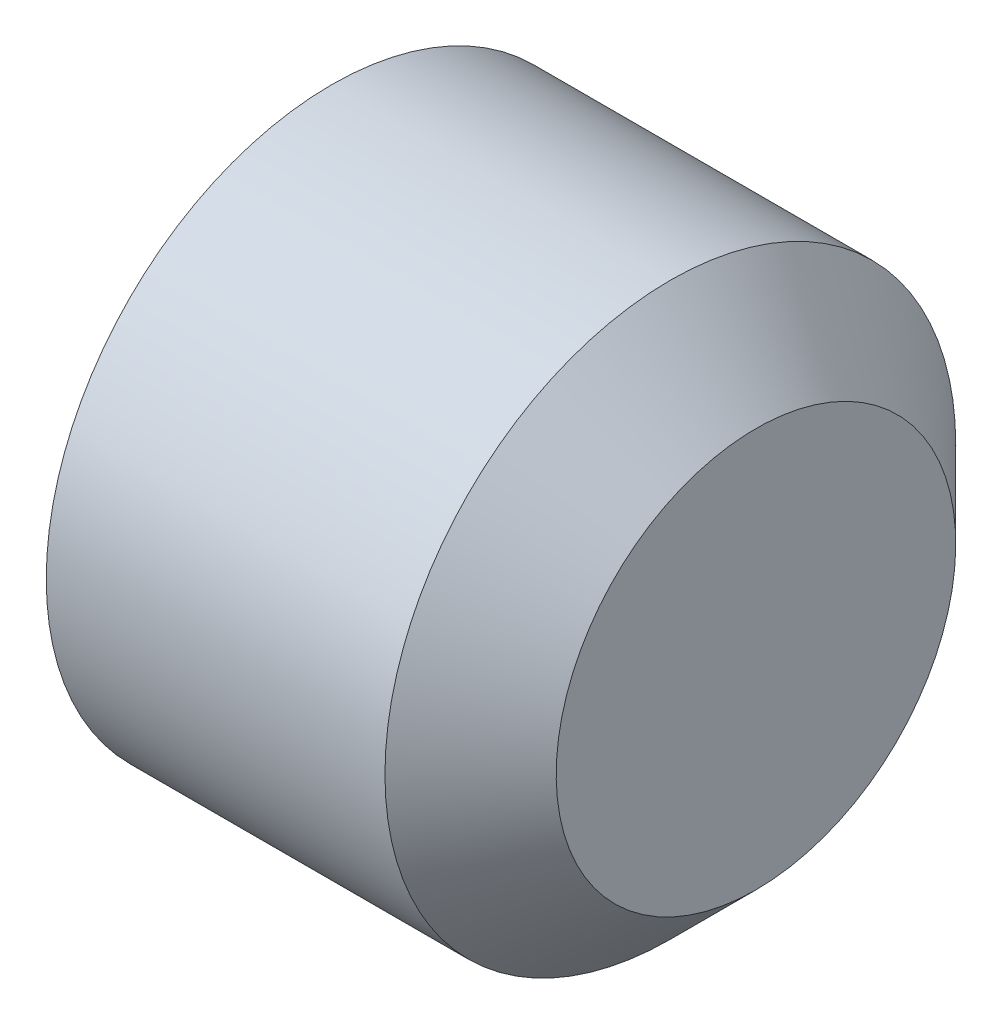
ISO-10303-21;
HEADER;
FILE_DESCRIPTION(('STEP AP214'),'2;1');
FILE_NAME('part.step','',(''),(''),'','','');
FILE_SCHEMA(('AUTOMOTIVE_DESIGN { 1 0 10303 214 1 1 1 1 }'));
ENDSEC;
DATA;
#1=APPLICATION_CONTEXT('core data for automotive mechanical design processes');
#2=APPLICATION_PROTOCOL_DEFINITION('international standard','automotive_design',2000,#1);
#3=PRODUCT_CONTEXT('',#1,'mechanical');
#4=PRODUCT('Part','Part','',(#3));
#5=PRODUCT_RELATED_PRODUCT_CATEGORY('part','',(#4));
#6=PRODUCT_DEFINITION_FORMATION('','',#4);
#7=PRODUCT_DEFINITION_CONTEXT('part definition',#1,'design');
#8=PRODUCT_DEFINITION('design','',#6,#7);
#9=PRODUCT_DEFINITION_SHAPE('','',#8);
#10=(LENGTH_UNIT() NAMED_UNIT(*) SI_UNIT(.MILLI.,.METRE.));
#11=(NAMED_UNIT(*) PLANE_ANGLE_UNIT() SI_UNIT($,.RADIAN.));
#12=(NAMED_UNIT(*) SI_UNIT($,.STERADIAN.) SOLID_ANGLE_UNIT());
#13=UNCERTAINTY_MEASURE_WITH_UNIT(LENGTH_MEASURE(1.E-05),#10,'distance_accuracy_value','');
#14=(GEOMETRIC_REPRESENTATION_CONTEXT(3) GLOBAL_UNCERTAINTY_ASSIGNED_CONTEXT((#13)) GLOBAL_UNIT_ASSIGNED_CONTEXT((#10,
#11,#12)) REPRESENTATION_CONTEXT('',''));
#15=CARTESIAN_POINT('',(0.,0.,0.));
#16=DIRECTION('',(0.,0.,1.));
#17=DIRECTION('',(1.,0.,0.));
#18=AXIS2_PLACEMENT_3D('',#15,#16,#17);
#19=CARTESIAN_POINT('',(0.83333333333333,0.,0.));
#20=DIRECTION('',(-1.,0.,0.));
#21=DIRECTION('',(0.,-1.,0.));
#22=AXIS2_PLACEMENT_3D('',#19,#20,#21);
#23=CONICAL_SURFACE('',#22,0.,1.04719755119661);
#24=CARTESIAN_POINT('',(0.,0.,0.));
#25=DIRECTION('',(-1.,0.,0.));
#26=DIRECTION('',(0.,-1.,0.));
#27=AXIS2_PLACEMENT_3D('',#24,#25,#26);
#28=CIRCLE('',#27,1.4433756729741);
#29=CARTESIAN_POINT('',(0.,0.,1.4433756729741));
#30=VERTEX_POINT('',#29);
#31=CARTESIAN_POINT('',(0.,1.25000000000006,0.721687836486994));
#32=VERTEX_POINT('',#31);
#33=EDGE_CURVE('E133',#30,#32,#28,.T.);
#34=ORIENTED_EDGE('',*,*,#33,.T.);
#35=CARTESIAN_POINT('',(-6.66746660057507E-05,1.2502,0.721572366433192));
#36=CARTESIAN_POINT('',(0.0182540852363299,1.19526669476824,0.753288124996229));
#37=CARTESIAN_POINT('',(0.0349166937993817,1.13985921349976,0.785277649221703));
#38=CARTESIAN_POINT('',(0.0640026960542466,1.02808463239966,0.849810733708406));
#39=CARTESIAN_POINT('',(0.0764157980239653,0.971715545158294,0.882355441401186));
#40=CARTESIAN_POINT('',(0.0957403123640013,0.859676025913021,0.947041487997324));
#41=CARTESIAN_POINT('',(0.10278031055258,0.804022841540777,0.979172868975901));
#42=CARTESIAN_POINT('',(0.111187567369377,0.692454346091617,1.04358696985656));
#43=CARTESIAN_POINT('',(0.112561784795285,0.636539441062409,1.07586945532689));
#44=CARTESIAN_POINT('',(0.109716662632088,0.532042078818284,1.13620103554814));
#45=CARTESIAN_POINT('',(0.106195901179992,0.483444050118692,1.16425912049994));
#46=CARTESIAN_POINT('',(0.0950328873007498,0.386564637826768,1.22019247526561));
#47=CARTESIAN_POINT('',(0.0873868144273279,0.338283589807842,1.2480675513361));
#48=CARTESIAN_POINT('',(0.0682705452994721,0.241204116145961,1.30411641158758));
#49=CARTESIAN_POINT('',(0.0567192430203453,0.192417989648104,1.33228309485383));
#50=CARTESIAN_POINT('',(0.0305016853061097,0.0955737477078994,1.38819614400748));
#51=CARTESIAN_POINT('',(0.0158415978608947,0.0475143896730365,1.41594322730599));
#52=CARTESIAN_POINT('',(-6.66746660267868E-05,-0.000199999999999914,1.44349114302794));
#53=B_SPLINE_CURVE_WITH_KNOTS('',3,(#35,#36,#37,#38,#39,#40,#41,#42,#43,#44,#45,#46,#47,#48,#49,
#50,#51,#52),.UNSPECIFIED.,.F.,.F.,(4,2,2,2,2,2,2,2,4),(0.,0.198150821029559,0.396778196315219,
0.590488617354397,0.783961049317179,0.952480056398648,1.1211553973001,1.29357430343591,
1.46565426976932),.UNSPECIFIED.);
#54=EDGE_CURVE('E11',#32,#30,#53,.T.);
#55=ORIENTED_EDGE('',*,*,#54,.T.);
#56=EDGE_LOOP('',(#34,#55));
#57=FACE_BOUND('',#56,.T.);
#58=ADVANCED_FACE('F31',(#57),#23,.F.);
#59=CARTESIAN_POINT('',(0.,-1.25,0.72168783648703));
#60=VERTEX_POINT('',#59);
#61=EDGE_CURVE('E129',#60,#30,#28,.T.);
#62=ORIENTED_EDGE('',*,*,#61,.T.);
#63=CARTESIAN_POINT('',(-6.66746660268218E-05,0.0002,1.44349114302794));
#64=CARTESIAN_POINT('',(0.0182540852363107,-0.0547333052317656,1.4117753844649));
#65=CARTESIAN_POINT('',(0.0349166937993643,-0.11014078650024,1.37978586023943));
#66=CARTESIAN_POINT('',(0.064002696054233,-0.221915367600341,1.31525277575272));
#67=CARTESIAN_POINT('',(0.0764157980239536,-0.278284454841712,1.28270806805994));
#68=CARTESIAN_POINT('',(0.0957403123639935,-0.390323974086986,1.2180220214638));
#69=CARTESIAN_POINT('',(0.102780310552574,-0.445977158459232,1.18589064048522));
#70=CARTESIAN_POINT('',(0.111187567369375,-0.557545653908395,1.12147653960457));
#71=CARTESIAN_POINT('',(0.112561784795285,-0.613460558937604,1.08919405413424));
#72=CARTESIAN_POINT('',(0.109716662632091,-0.717957921181728,1.02886247391298));
#73=CARTESIAN_POINT('',(0.106195901179996,-0.766555949881319,1.00080438896119));
#74=CARTESIAN_POINT('',(0.0950328873007579,-0.863435362173241,0.944871034195512));
#75=CARTESIAN_POINT('',(0.0873868144273378,-0.911716410192165,0.916995958125027));
#76=CARTESIAN_POINT('',(0.0682705452994854,-1.00879588385404,0.860947097873551));
#77=CARTESIAN_POINT('',(0.0567192430203601,-1.0575820103519,0.832780414607293));
#78=CARTESIAN_POINT('',(0.0305016853061277,-1.1544262522921,0.776867365453649));
#79=CARTESIAN_POINT('',(0.0158415978609142,-1.20248561032696,0.74912028215514));
#80=CARTESIAN_POINT('',(-6.66746660054578E-05,-1.2502,0.721572366433192));
#81=B_SPLINE_CURVE_WITH_KNOTS('',3,(#63,#64,#65,#66,#67,#68,#69,#70,#71,#72,#73,#74,#75,#76,#77,
#78,#79,#80),.UNSPECIFIED.,.F.,.F.,(4,2,2,2,2,2,2,2,4),(0.,0.198150821029564,0.396778196315229,
0.590488617354412,0.783961049317198,0.952480056398663,1.12115539730011,1.29357430343592,
1.46565426976932),.UNSPECIFIED.);
#82=EDGE_CURVE('E44',#30,#60,#81,.T.);
#83=ORIENTED_EDGE('',*,*,#82,.T.);
#84=EDGE_LOOP('',(#62,#83));
#85=FACE_BOUND('',#84,.T.);
#86=ADVANCED_FACE('F199',(#85),#23,.F.);
#87=CARTESIAN_POINT('',(0.,-1.25,-0.72168783648703));
#88=VERTEX_POINT('',#87);
#89=EDGE_CURVE('E128',#88,#60,#28,.T.);
#90=ORIENTED_EDGE('',*,*,#89,.T.);
#91=CARTESIAN_POINT('',(-0.464794110924318,-1.25,-1.8689314017922));
#92=CARTESIAN_POINT('',(-0.438896838466503,-1.25,-1.81495202267028));
#93=CARTESIAN_POINT('',(-0.41326862193117,-1.25,-1.76084125344199));
#94=CARTESIAN_POINT('',(-0.362702760613372,-1.25,-1.65228662652069));
#95=CARTESIAN_POINT('',(-0.337765240110292,-1.25,-1.5978427110077));
#96=CARTESIAN_POINT('',(-0.288593916349812,-1.25,-1.48823931692677));
#97=CARTESIAN_POINT('',(-0.26436529948678,-1.25,-1.43307750108909));
#98=CARTESIAN_POINT('',(-0.216995070503893,-1.25,-1.32229188443623));
#99=CARTESIAN_POINT('',(-0.1938534018645,-1.25,-1.26666810781964));
#100=CARTESIAN_POINT('',(-0.148354613067788,-1.25,-1.15340083047609));
#101=CARTESIAN_POINT('',(-0.126033815465283,-1.25,-1.09574254265117));
#102=CARTESIAN_POINT('',(-0.0832554769119706,-1.25,-0.979741082890187));
#103=CARTESIAN_POINT('',(-0.0627981694396737,-1.25,-0.921397826164648));
#104=CARTESIAN_POINT('',(-0.00508423767620013,-1.25,-0.745435524772247));
#105=CARTESIAN_POINT('',(0.0286497850231129,-1.25,-0.626561938132864));
#106=CARTESIAN_POINT('',(0.0677795931717896,-1.25,-0.445873083681241));
#107=CARTESIAN_POINT('',(0.0789059393811716,-1.25,-0.38530470019277));
#108=CARTESIAN_POINT('',(0.0965721477324262,-1.25,-0.263486592065033));
#109=CARTESIAN_POINT('',(0.103112319816836,-1.25,-0.202236913753249));
#110=CARTESIAN_POINT('',(0.111001218957225,-1.25,-0.0801324468775871));
#111=CARTESIAN_POINT('',(0.112411208741845,-1.25,-0.019281719788719));
#112=CARTESIAN_POINT('',(0.110083812113811,-1.25,0.102319232701149));
#113=CARTESIAN_POINT('',(0.106346106973973,-1.25,0.163069451645857));
#114=CARTESIAN_POINT('',(0.0911019719638763,-1.25,0.312961598922923));
#115=CARTESIAN_POINT('',(0.0767387515703198,-1.25,0.401813055628261));
#116=CARTESIAN_POINT('',(0.0397001504850786,-1.25,0.577788146583204));
#117=CARTESIAN_POINT('',(0.0170147516458729,-1.25,0.664909564430757));
#118=CARTESIAN_POINT('',(-0.0217374532821145,-1.25,0.795209224728803));
#119=CARTESIAN_POINT('',(-0.0356229448102494,-1.25,0.839061001813546));
#120=CARTESIAN_POINT('',(-0.0646784153621007,-1.25,0.926308087473968));
#121=CARTESIAN_POINT('',(-0.0798475927664179,-1.25,0.969703662172476));
#122=CARTESIAN_POINT('',(-0.111250133996538,-1.25,1.05609633508796));
#123=CARTESIAN_POINT('',(-0.127483304422964,-1.25,1.09909350410935));
#124=CARTESIAN_POINT('',(-0.160838243910764,-1.25,1.18474903910482));
#125=CARTESIAN_POINT('',(-0.177960163104321,-1.25,1.22740734642401));
#126=CARTESIAN_POINT('',(-0.222761429232114,-1.25,1.33629459550827));
#127=CARTESIAN_POINT('',(-0.250969383573501,-1.25,1.40230581092031));
#128=CARTESIAN_POINT('',(-0.308745081158461,-1.25,1.53373213594215));
#129=CARTESIAN_POINT('',(-0.338312926269894,-1.25,1.59914720045377));
#130=CARTESIAN_POINT('',(-0.428576920024366,-1.25,1.79469680395945));
#131=CARTESIAN_POINT('',(-0.490824273185166,-1.25,1.92411390982371));
#132=CARTESIAN_POINT('',(-0.617929622902712,-1.25,2.18184246876939));
#133=CARTESIAN_POINT('',(-0.682790734765016,-1.25,2.31015236703664));
#134=CARTESIAN_POINT('',(-0.814180745531417,-1.25,2.56589305685458));
#135=CARTESIAN_POINT('',(-0.880709432442646,-1.25,2.6933239575489));
#136=CARTESIAN_POINT('',(-1.0085820016458,-1.25,2.93557826301824));
#137=CARTESIAN_POINT('',(-1.06982257041214,-1.25,3.05045639113078));
#138=CARTESIAN_POINT('',(-1.19300148004088,-1.25,3.27984311898858));
#139=CARTESIAN_POINT('',(-1.25493984672611,-1.25,3.39435170485541));
#140=CARTESIAN_POINT('',(-1.3791811560561,-1.25,3.62279327872171));
#141=CARTESIAN_POINT('',(-1.44148277067592,-1.25,3.73672698995316));
#142=CARTESIAN_POINT('',(-1.56649149193143,-1.25,3.96436406629498));
#143=CARTESIAN_POINT('',(-1.62919857717608,-1.25,4.07806744314791));
#144=CARTESIAN_POINT('',(-1.69205434936227,-1.25,4.19168806612957));
#145=B_SPLINE_CURVE_WITH_KNOTS('',3,(#91,#92,#93,#94,#95,#96,#97,#98,#99,#100,#101,#102,#103,
#104,#105,#106,#107,#108,#109,#110,#111,#112,#113,#114,#115,#116,#117,#118,#119,#120,#121,#122,
#123,#124,#125,#126,#127,#128,#129,#130,#131,#132,#133,#134,#135,#136,#137,#138,#139,#140,#141,
#142,#143,#144),.UNSPECIFIED.,.F.,.F.,(4,2,2,2,2,2,2,2,2,2,2,2,2,2,2,2,2,2,2,2,2,2,2,2,2,2,4),
(0.,0.17961292671252,0.359257964580633,0.539992735616922,0.720718098311231,0.906167781883899,
1.09164066876281,1.46154014621253,1.64614554413151,1.83073846485716,2.01311967401944,
2.1955121760931,2.46497297688039,2.73475922178122,2.87273702323334,3.01062928909403,
3.14849655975692,3.28638719597095,3.50172172546914,3.71707241178646,4.14784491349871,
4.57914698286388,5.01039449766875,5.40093821140483,5.79149642546544,6.18106124184777,
6.57060567131898),.UNSPECIFIED.);
#146=EDGE_CURVE('E175',#60,#88,#145,.F.);
#147=ORIENTED_EDGE('',*,*,#146,.T.);
#148=EDGE_LOOP('',(#90,#147));
#149=FACE_BOUND('',#148,.T.);
#150=ADVANCED_FACE('F205',(#149),#23,.F.);
#151=CARTESIAN_POINT('',(0.,0.,-1.4433756729741));
#152=VERTEX_POINT('',#151);
#153=EDGE_CURVE('E227',#152,#88,#28,.T.);
#154=ORIENTED_EDGE('',*,*,#153,.T.);
#155=CARTESIAN_POINT('',(-6.66746660055277E-05,-1.2502,-0.721572366433192));
#156=CARTESIAN_POINT('',(0.0182540852363301,-1.19526669476824,-0.753288124996229));
#157=CARTESIAN_POINT('',(0.0349166937993819,-1.13985921349976,-0.785277649221703));
#158=CARTESIAN_POINT('',(0.0640026960542469,-1.02808463239966,-0.849810733708406));
#159=CARTESIAN_POINT('',(0.0764157980239655,-0.971715545158294,-0.882355441401186));
#160=CARTESIAN_POINT('',(0.0957403123640015,-0.859676025913021,-0.947041487997324));
#161=CARTESIAN_POINT('',(0.10278031055258,-0.804022841540777,-0.979172868975901));
#162=CARTESIAN_POINT('',(0.111187567369377,-0.692454346091617,-1.04358696985656));
#163=CARTESIAN_POINT('',(0.112561784795285,-0.636539441062409,-1.07586945532689));
#164=CARTESIAN_POINT('',(0.109716662632088,-0.532042078818284,-1.13620103554814));
#165=CARTESIAN_POINT('',(0.106195901179992,-0.483444050118692,-1.16425912049994));
#166=CARTESIAN_POINT('',(0.0950328873007499,-0.386564637826768,-1.22019247526561));
#167=CARTESIAN_POINT('',(0.087386814427328,-0.338283589807842,-1.2480675513361));
#168=CARTESIAN_POINT('',(0.0682705452994722,-0.241204116145961,-1.30411641158758));
#169=CARTESIAN_POINT('',(0.0567192430203453,-0.192417989648104,-1.33228309485383));
#170=CARTESIAN_POINT('',(0.0305016853061096,-0.0955737477078995,-1.38819614400748));
#171=CARTESIAN_POINT('',(0.0158415978608945,-0.0475143896730366,-1.41594322730599));
#172=CARTESIAN_POINT('',(-6.66746660268274E-05,0.000199999999999906,-1.44349114302794));
#173=B_SPLINE_CURVE_WITH_KNOTS('',3,(#155,#156,#157,#158,#159,#160,#161,#162,#163,#164,#165,
#166,#167,#168,#169,#170,#171,#172),.UNSPECIFIED.,.F.,.F.,(4,2,2,2,2,2,2,2,4),(0.,
0.198150821029559,0.396778196315219,0.590488617354397,0.783961049317179,0.952480056398648,
1.1211553973001,1.29357430343591,1.46565426976932),.UNSPECIFIED.);
#174=EDGE_CURVE('E170',#88,#152,#173,.T.);
#175=ORIENTED_EDGE('',*,*,#174,.T.);
#176=EDGE_LOOP('',(#154,#175));
#177=FACE_BOUND('',#176,.T.);
#178=ADVANCED_FACE('F217',(#177),#23,.F.);
#179=CARTESIAN_POINT('',(0.,1.25,-0.72168783648703));
#180=VERTEX_POINT('',#179);
#181=EDGE_CURVE('E225',#180,#152,#28,.T.);
#182=ORIENTED_EDGE('',*,*,#181,.T.);
#183=CARTESIAN_POINT('',(-6.66746660268218E-05,-0.0002,-1.44349114302794));
#184=CARTESIAN_POINT('',(0.0182540852363106,0.0547333052317654,-1.4117753844649));
#185=CARTESIAN_POINT('',(0.0349166937993642,0.11014078650024,-1.37978586023943));
#186=CARTESIAN_POINT('',(0.064002696054233,0.221915367600341,-1.31525277575272));
#187=CARTESIAN_POINT('',(0.0764157980239536,0.278284454841712,-1.28270806805994));
#188=CARTESIAN_POINT('',(0.0957403123639934,0.390323974086986,-1.2180220214638));
#189=CARTESIAN_POINT('',(0.102780310552574,0.445977158459232,-1.18589064048522));
#190=CARTESIAN_POINT('',(0.111187567369375,0.557545653908395,-1.12147653960457));
#191=CARTESIAN_POINT('',(0.112561784795285,0.613460558937604,-1.08919405413424));
#192=CARTESIAN_POINT('',(0.109716662632091,0.717957921181728,-1.02886247391298));
#193=CARTESIAN_POINT('',(0.106195901179996,0.766555949881319,-1.00080438896119));
#194=CARTESIAN_POINT('',(0.0950328873007577,0.863435362173241,-0.944871034195511));
#195=CARTESIAN_POINT('',(0.0873868144273375,0.911716410192165,-0.916995958125027));
#196=CARTESIAN_POINT('',(0.068270545299485,1.00879588385404,-0.86094709787355));
#197=CARTESIAN_POINT('',(0.0567192430203599,1.0575820103519,-0.832780414607293));
#198=CARTESIAN_POINT('',(0.0305016853061276,1.1544262522921,-0.776867365453649));
#199=CARTESIAN_POINT('',(0.0158415978609141,1.20248561032696,-0.749120282155139));
#200=CARTESIAN_POINT('',(-6.66746660056587E-05,1.2502,-0.721572366433192));
#201=B_SPLINE_CURVE_WITH_KNOTS('',3,(#183,#184,#185,#186,#187,#188,#189,#190,#191,#192,#193,
#194,#195,#196,#197,#198,#199,#200),.UNSPECIFIED.,.F.,.F.,(4,2,2,2,2,2,2,2,4),(0.,
0.198150821029563,0.396778196315229,0.590488617354411,0.783961049317198,0.952480056398663,
1.12115539730011,1.29357430343592,1.46565426976932),.UNSPECIFIED.);
#202=EDGE_CURVE('E111',#152,#180,#201,.T.);
#203=ORIENTED_EDGE('',*,*,#202,.T.);
#204=EDGE_LOOP('',(#182,#203));
#205=FACE_BOUND('',#204,.T.);
#206=ADVANCED_FACE('F209',(#205),#23,.F.);
#207=EDGE_CURVE('E221',#32,#180,#28,.T.);
#208=ORIENTED_EDGE('',*,*,#207,.T.);
#209=CARTESIAN_POINT('',(-0.464794110924318,1.25,-1.8689314017922));
#210=CARTESIAN_POINT('',(-0.438896838466503,1.25,-1.81495202267028));
#211=CARTESIAN_POINT('',(-0.41326862193117,1.25,-1.76084125344199));
#212=CARTESIAN_POINT('',(-0.362702760613372,1.25,-1.65228662652069));
#213=CARTESIAN_POINT('',(-0.337765240110292,1.25,-1.5978427110077));
#214=CARTESIAN_POINT('',(-0.288593916349812,1.25,-1.48823931692677));
#215=CARTESIAN_POINT('',(-0.26436529948678,1.25,-1.43307750108909));
#216=CARTESIAN_POINT('',(-0.216995070503893,1.25,-1.32229188443623));
#217=CARTESIAN_POINT('',(-0.1938534018645,1.25,-1.26666810781964));
#218=CARTESIAN_POINT('',(-0.148354613067788,1.25,-1.15340083047609));
#219=CARTESIAN_POINT('',(-0.126033815465283,1.25,-1.09574254265117));
#220=CARTESIAN_POINT('',(-0.0832554769119707,1.25,-0.979741082890186));
#221=CARTESIAN_POINT('',(-0.0627981694396738,1.25,-0.921397826164648));
#222=CARTESIAN_POINT('',(-0.00508423767620024,1.25,-0.745435524772247));
#223=CARTESIAN_POINT('',(0.0286497850231128,1.25,-0.626561938132864));
#224=CARTESIAN_POINT('',(0.0677795931717894,1.25,-0.445873083681241));
#225=CARTESIAN_POINT('',(0.0789059393811713,1.25,-0.38530470019277));
#226=CARTESIAN_POINT('',(0.0965721477324259,1.25,-0.263486592065032));
#227=CARTESIAN_POINT('',(0.103112319816836,1.25,-0.202236913753249));
#228=CARTESIAN_POINT('',(0.111001218957225,1.25,-0.0801324468775868));
#229=CARTESIAN_POINT('',(0.112411208741845,1.25,-0.0192817197887186));
#230=CARTESIAN_POINT('',(0.110083812113811,1.25,0.10231923270115));
#231=CARTESIAN_POINT('',(0.106346106973973,1.25,0.163069451645857));
#232=CARTESIAN_POINT('',(0.091101971963876,1.25,0.312961598922923));
#233=CARTESIAN_POINT('',(0.0767387515703196,1.25,0.401813055628261));
#234=CARTESIAN_POINT('',(0.0397001504850782,1.25,0.577788146583204));
#235=CARTESIAN_POINT('',(0.0170147516458725,1.25,0.664909564430757));
#236=CARTESIAN_POINT('',(-0.0217374532821147,1.25,0.795209224728803));
#237=CARTESIAN_POINT('',(-0.0356229448102494,1.25,0.839061001813546));
#238=CARTESIAN_POINT('',(-0.0646784153621006,1.25,0.926308087473968));
#239=CARTESIAN_POINT('',(-0.0798475927664179,1.25,0.969703662172475));
#240=CARTESIAN_POINT('',(-0.111250133996538,1.25,1.05609633508796));
#241=CARTESIAN_POINT('',(-0.127483304422964,1.25,1.09909350410935));
#242=CARTESIAN_POINT('',(-0.160838243910764,1.25,1.18474903910482));
#243=CARTESIAN_POINT('',(-0.177960163104321,1.25,1.22740734642401));
#244=CARTESIAN_POINT('',(-0.222761429232114,1.25,1.33629459550828));
#245=CARTESIAN_POINT('',(-0.250969383573501,1.25,1.40230581092031));
#246=CARTESIAN_POINT('',(-0.30874508115846,1.25,1.53373213594215));
#247=CARTESIAN_POINT('',(-0.338312926269894,1.25,1.59914720045377));
#248=CARTESIAN_POINT('',(-0.428576920024366,1.25,1.79469680395945));
#249=CARTESIAN_POINT('',(-0.490824273185166,1.25,1.92411390982371));
#250=CARTESIAN_POINT('',(-0.617929622902713,1.25,2.18184246876939));
#251=CARTESIAN_POINT('',(-0.682790734765016,1.25,2.31015236703664));
#252=CARTESIAN_POINT('',(-0.814180745531417,1.25,2.56589305685458));
#253=CARTESIAN_POINT('',(-0.880709432442647,1.25,2.6933239575489));
#254=CARTESIAN_POINT('',(-1.0085820016458,1.25,2.93557826301824));
#255=CARTESIAN_POINT('',(-1.06982257041214,1.25,3.05045639113078));
#256=CARTESIAN_POINT('',(-1.19300148004088,1.25,3.27984311898858));
#257=CARTESIAN_POINT('',(-1.25493984672611,1.25,3.39435170485541));
#258=CARTESIAN_POINT('',(-1.3791811560561,1.25,3.62279327872171));
#259=CARTESIAN_POINT('',(-1.44148277067592,1.25,3.73672698995316));
#260=CARTESIAN_POINT('',(-1.56649149193143,1.25,3.96436406629498));
#261=CARTESIAN_POINT('',(-1.62919857717608,1.25,4.07806744314791));
#262=CARTESIAN_POINT('',(-1.69205434936227,1.25,4.19168806612957));
#263=B_SPLINE_CURVE_WITH_KNOTS('',3,(#209,#210,#211,#212,#213,#214,#215,#216,#217,#218,#219,
#220,#221,#222,#223,#224,#225,#226,#227,#228,#229,#230,#231,#232,#233,#234,#235,#236,#237,#238,
#239,#240,#241,#242,#243,#244,#245,#246,#247,#248,#249,#250,#251,#252,#253,#254,#255,#256,#257,
#258,#259,#260,#261,#262),.UNSPECIFIED.,.F.,.F.,(4,2,2,2,2,2,2,2,2,2,2,2,2,2,2,2,2,2,2,2,2,2,2,
2,2,2,4),(0.,0.17961292671252,0.359257964580634,0.539992735616922,0.720718098311231,
0.9061677818839,1.09164066876281,1.46154014621253,1.64614554413151,1.83073846485716,
2.01311967401944,2.1955121760931,2.46497297688039,2.73475922178122,2.87273702323334,
3.01062928909402,3.14849655975692,3.28638719597095,3.50172172546914,3.71707241178646,
4.14784491349871,4.57914698286388,5.01039449766875,5.40093821140483,5.79149642546544,
6.18106124184777,6.57060567131898),.UNSPECIFIED.);
#264=EDGE_CURVE('E77',#180,#32,#263,.T.);
#265=ORIENTED_EDGE('',*,*,#264,.T.);
#266=EDGE_LOOP('',(#208,#265));
#267=FACE_BOUND('',#266,.T.);
#268=ADVANCED_FACE('F201',(#267),#23,.F.);
#269=CARTESIAN_POINT('',(4.,0.,0.));
#270=DIRECTION('',(1.,0.,0.));
#271=DIRECTION('',(0.,1.,0.));
#272=AXIS2_PLACEMENT_3D('',#269,#270,#271);
#273=PLANE('',#272);
#274=CARTESIAN_POINT('',(4.,0.,0.));
#275=DIRECTION('',(-1.,0.,0.));
#276=DIRECTION('',(0.,-1.,0.));
#277=AXIS2_PLACEMENT_3D('',#274,#275,#276);
#278=CIRCLE('',#277,1.75);
#279=CARTESIAN_POINT('',(4.,-1.75,0.));
#280=VERTEX_POINT('',#279);
#281=EDGE_CURVE('E142',#280,#280,#278,.T.);
#282=ORIENTED_EDGE('',*,*,#281,.F.);
#283=EDGE_LOOP('',(#282));
#284=FACE_BOUND('',#283,.T.);
#285=ADVANCED_FACE('F33',(#284),#273,.T.);
#286=CARTESIAN_POINT('',(3.25,0.,0.));
#287=DIRECTION('',(-1.,0.,0.));
#288=DIRECTION('',(0.,-1.,0.));
#289=AXIS2_PLACEMENT_3D('',#286,#287,#288);
#290=CONICAL_SURFACE('',#289,2.5,0.785398163397448);
#291=ORIENTED_EDGE('',*,*,#281,.T.);
#292=EDGE_LOOP('',(#291));
#293=FACE_BOUND('',#292,.T.);
#294=CARTESIAN_POINT('',(3.25,0.,0.));
#295=DIRECTION('',(-1.,0.,0.));
#296=DIRECTION('',(0.,-1.,0.));
#297=AXIS2_PLACEMENT_3D('',#294,#295,#296);
#298=CIRCLE('',#297,2.5);
#299=CARTESIAN_POINT('',(3.25,-2.5,0.));
#300=VERTEX_POINT('',#299);
#301=EDGE_CURVE('E139',#300,#300,#298,.T.);
#302=ORIENTED_EDGE('',*,*,#301,.F.);
#303=EDGE_LOOP('',(#302));
#304=FACE_BOUND('',#303,.T.);
#305=ADVANCED_FACE('F215',(#293,#304),#290,.T.);
#306=CARTESIAN_POINT('',(0.83333333333333,0.,0.));
#307=DIRECTION('',(-1.,0.,0.));
#308=DIRECTION('',(0.,-1.,0.));
#309=AXIS2_PLACEMENT_3D('',#306,#307,#308);
#310=CYLINDRICAL_SURFACE('',#309,2.5);
#311=ORIENTED_EDGE('',*,*,#301,.T.);
#312=EDGE_LOOP('',(#311));
#313=FACE_BOUND('',#312,.T.);
#314=CARTESIAN_POINT('',(0.28319030703751,0.,0.));
#315=DIRECTION('',(-1.,0.,0.));
#316=DIRECTION('',(0.,-1.,0.));
#317=AXIS2_PLACEMENT_3D('',#314,#315,#316);
#318=CIRCLE('',#317,2.5);
#319=CARTESIAN_POINT('',(0.28319030703751,-2.5,0.));
#320=VERTEX_POINT('',#319);
#321=EDGE_CURVE('E136',#320,#320,#318,.T.);
#322=ORIENTED_EDGE('',*,*,#321,.F.);
#323=EDGE_LOOP('',(#322));
#324=FACE_BOUND('',#323,.T.);
#325=ADVANCED_FACE('F324',(#313,#324),#310,.T.);
#326=CARTESIAN_POINT('',(0.,0.,0.));
#327=DIRECTION('',(1.,0.,0.));
#328=DIRECTION('',(0.,1.,0.));
#329=AXIS2_PLACEMENT_3D('',#326,#327,#328);
#330=CONICAL_SURFACE('',#329,2.0095,1.0471975511966);
#331=ORIENTED_EDGE('',*,*,#321,.T.);
#332=EDGE_LOOP('',(#331));
#333=FACE_BOUND('',#332,.T.);
#334=CARTESIAN_POINT('',(0.,0.,0.));
#335=DIRECTION('',(-1.,0.,0.));
#336=DIRECTION('',(0.,-1.,0.));
#337=AXIS2_PLACEMENT_3D('',#334,#335,#336);
#338=CIRCLE('',#337,2.0095);
#339=CARTESIAN_POINT('',(0.,-2.0095,0.));
#340=VERTEX_POINT('',#339);
#341=EDGE_CURVE('E132',#340,#340,#338,.T.);
#342=ORIENTED_EDGE('',*,*,#341,.F.);
#343=EDGE_LOOP('',(#342));
#344=FACE_BOUND('',#343,.T.);
#345=ADVANCED_FACE('F196',(#333,#344),#330,.T.);
#346=CARTESIAN_POINT('',(0.,-2.0095,0.));
#347=DIRECTION('',(-1.,0.,0.));
#348=DIRECTION('',(0.,-1.,0.));
#349=AXIS2_PLACEMENT_3D('',#346,#347,#348);
#350=PLANE('',#349);
#351=ORIENTED_EDGE('',*,*,#341,.T.);
#352=EDGE_LOOP('',(#351));
#353=FACE_BOUND('',#352,.T.);
#354=ORIENTED_EDGE('',*,*,#61,.F.);
#355=ORIENTED_EDGE('',*,*,#89,.F.);
#356=ORIENTED_EDGE('',*,*,#153,.F.);
#357=ORIENTED_EDGE('',*,*,#181,.F.);
#358=ORIENTED_EDGE('',*,*,#207,.F.);
#359=ORIENTED_EDGE('',*,*,#33,.F.);
#360=EDGE_LOOP('',(#354,#355,#356,#357,#358,#359));
#361=FACE_BOUND('',#360,.T.);
#362=ADVANCED_FACE('F191',(#353,#361),#350,.T.);
#363=CARTESIAN_POINT('',(2.,1.25,0.72168783648703));
#364=DIRECTION('',(0.,-0.50000000000002,-0.866025403784427));
#365=DIRECTION('',(0.,0.866025403784427,-0.50000000000002));
#366=AXIS2_PLACEMENT_3D('',#363,#364,#365);
#367=PLANE('',#366);
#368=DIRECTION('',(-1.,0.,0.));
#369=VECTOR('',#368,1.);
#370=CARTESIAN_POINT('',(2.,1.25,0.72168783648703));
#371=LINE('',#370,#369);
#372=CARTESIAN_POINT('',(2.,1.25,0.72168783648703));
#373=VERTEX_POINT('',#372);
#374=EDGE_CURVE('E51',#373,#32,#371,.T.);
#375=ORIENTED_EDGE('',*,*,#374,.F.);
#376=DIRECTION('',(0.,-0.866025403784427,0.50000000000002));
#377=VECTOR('',#376,1.);
#378=CARTESIAN_POINT('',(2.,1.25,0.72168783648703));
#379=LINE('',#378,#377);
#380=CARTESIAN_POINT('',(2.,0.,1.4433756729741));
#381=VERTEX_POINT('',#380);
#382=EDGE_CURVE('E237',#373,#381,#379,.T.);
#383=ORIENTED_EDGE('',*,*,#382,.T.);
#384=DIRECTION('',(-1.,0.,0.));
#385=VECTOR('',#384,1.);
#386=CARTESIAN_POINT('',(2.,0.,1.4433756729741));
#387=LINE('',#386,#385);
#388=EDGE_CURVE('E125',#381,#30,#387,.T.);
#389=ORIENTED_EDGE('',*,*,#388,.T.);
#390=ORIENTED_EDGE('',*,*,#54,.F.);
#391=EDGE_LOOP('',(#375,#383,#389,#390));
#392=FACE_BOUND('',#391,.T.);
#393=ADVANCED_FACE('F187',(#392),#367,.T.);
#394=CARTESIAN_POINT('',(2.,0.,1.4433756729741));
#395=DIRECTION('',(0.,0.50000000000002,-0.866025403784427));
#396=DIRECTION('',(0.,0.866025403784427,0.50000000000002));
#397=AXIS2_PLACEMENT_3D('',#394,#395,#396);
#398=PLANE('',#397);
#399=ORIENTED_EDGE('',*,*,#388,.F.);
#400=DIRECTION('',(0.,-0.866025403784427,-0.50000000000002));
#401=VECTOR('',#400,1.);
#402=CARTESIAN_POINT('',(2.,0.,1.4433756729741));
#403=LINE('',#402,#401);
#404=CARTESIAN_POINT('',(2.,-1.25,0.72168783648703));
#405=VERTEX_POINT('',#404);
#406=EDGE_CURVE('E86',#381,#405,#403,.T.);
#407=ORIENTED_EDGE('',*,*,#406,.T.);
#408=DIRECTION('',(-1.,0.,0.));
#409=VECTOR('',#408,1.);
#410=CARTESIAN_POINT('',(2.,-1.25,0.72168783648703));
#411=LINE('',#410,#409);
#412=EDGE_CURVE('E122',#405,#60,#411,.T.);
#413=ORIENTED_EDGE('',*,*,#412,.T.);
#414=ORIENTED_EDGE('',*,*,#82,.F.);
#415=EDGE_LOOP('',(#399,#407,#413,#414));
#416=FACE_BOUND('',#415,.T.);
#417=ADVANCED_FACE('F184',(#416),#398,.T.);
#418=CARTESIAN_POINT('',(2.,-1.25,0.72168783648703));
#419=DIRECTION('',(0.,1.,0.));
#420=DIRECTION('',(0.,0.,1.));
#421=AXIS2_PLACEMENT_3D('',#418,#419,#420);
#422=PLANE('',#421);
#423=ORIENTED_EDGE('',*,*,#412,.F.);
#424=DIRECTION('',(0.,0.,-1.));
#425=VECTOR('',#424,1.);
#426=CARTESIAN_POINT('',(2.,-1.25,0.72168783648703));
#427=LINE('',#426,#425);
#428=CARTESIAN_POINT('',(2.,-1.25,-0.72168783648703));
#429=VERTEX_POINT('',#428);
#430=EDGE_CURVE('E106',#405,#429,#427,.T.);
#431=ORIENTED_EDGE('',*,*,#430,.T.);
#432=DIRECTION('',(-1.,0.,0.));
#433=VECTOR('',#432,1.);
#434=CARTESIAN_POINT('',(2.,-1.25,-0.72168783648703));
#435=LINE('',#434,#433);
#436=EDGE_CURVE('E103',#429,#88,#435,.T.);
#437=ORIENTED_EDGE('',*,*,#436,.T.);
#438=ORIENTED_EDGE('',*,*,#146,.F.);
#439=EDGE_LOOP('',(#423,#431,#437,#438));
#440=FACE_BOUND('',#439,.T.);
#441=ADVANCED_FACE('F167',(#440),#422,.T.);
#442=CARTESIAN_POINT('',(2.,-1.25,-0.72168783648703));
#443=DIRECTION('',(0.,0.50000000000002,0.866025403784427));
#444=DIRECTION('',(0.,-0.866025403784427,0.50000000000002));
#445=AXIS2_PLACEMENT_3D('',#442,#443,#444);
#446=PLANE('',#445);
#447=ORIENTED_EDGE('',*,*,#436,.F.);
#448=DIRECTION('',(0.,0.866025403784427,-0.50000000000002));
#449=VECTOR('',#448,1.);
#450=CARTESIAN_POINT('',(2.,-1.25,-0.72168783648703));
#451=LINE('',#450,#449);
#452=CARTESIAN_POINT('',(2.,0.,-1.4433756729741));
#453=VERTEX_POINT('',#452);
#454=EDGE_CURVE('E97',#429,#453,#451,.T.);
#455=ORIENTED_EDGE('',*,*,#454,.T.);
#456=DIRECTION('',(-1.,0.,0.));
#457=VECTOR('',#456,1.);
#458=CARTESIAN_POINT('',(2.,0.,-1.4433756729741));
#459=LINE('',#458,#457);
#460=EDGE_CURVE('E100',#453,#152,#459,.T.);
#461=ORIENTED_EDGE('',*,*,#460,.T.);
#462=ORIENTED_EDGE('',*,*,#174,.F.);
#463=EDGE_LOOP('',(#447,#455,#461,#462));
#464=FACE_BOUND('',#463,.T.);
#465=ADVANCED_FACE('F99',(#464),#446,.T.);
#466=CARTESIAN_POINT('',(2.,0.,-1.4433756729741));
#467=DIRECTION('',(0.,-0.50000000000002,0.866025403784427));
#468=DIRECTION('',(0.,-0.866025403784427,-0.50000000000002));
#469=AXIS2_PLACEMENT_3D('',#466,#467,#468);
#470=PLANE('',#469);
#471=ORIENTED_EDGE('',*,*,#460,.F.);
#472=DIRECTION('',(0.,0.866025403784427,0.50000000000002));
#473=VECTOR('',#472,1.);
#474=CARTESIAN_POINT('',(2.,0.,-1.4433756729741));
#475=LINE('',#474,#473);
#476=CARTESIAN_POINT('',(2.,1.25,-0.72168783648703));
#477=VERTEX_POINT('',#476);
#478=EDGE_CURVE('E105',#453,#477,#475,.T.);
#479=ORIENTED_EDGE('',*,*,#478,.T.);
#480=DIRECTION('',(-1.,0.,0.));
#481=VECTOR('',#480,1.);
#482=CARTESIAN_POINT('',(2.,1.25,-0.72168783648703));
#483=LINE('',#482,#481);
#484=EDGE_CURVE('E112',#477,#180,#483,.T.);
#485=ORIENTED_EDGE('',*,*,#484,.T.);
#486=ORIENTED_EDGE('',*,*,#202,.F.);
#487=EDGE_LOOP('',(#471,#479,#485,#486));
#488=FACE_BOUND('',#487,.T.);
#489=ADVANCED_FACE('F109',(#488),#470,.T.);
#490=CARTESIAN_POINT('',(2.,1.25,-0.72168783648703));
#491=DIRECTION('',(0.,-1.,0.));
#492=DIRECTION('',(0.,0.,-1.));
#493=AXIS2_PLACEMENT_3D('',#490,#491,#492);
#494=PLANE('',#493);
#495=ORIENTED_EDGE('',*,*,#484,.F.);
#496=DIRECTION('',(0.,0.,1.));
#497=VECTOR('',#496,1.);
#498=CARTESIAN_POINT('',(2.,1.25,-0.72168783648703));
#499=LINE('',#498,#497);
#500=EDGE_CURVE('E57',#477,#373,#499,.T.);
#501=ORIENTED_EDGE('',*,*,#500,.T.);
#502=ORIENTED_EDGE('',*,*,#374,.T.);
#503=ORIENTED_EDGE('',*,*,#264,.F.);
#504=EDGE_LOOP('',(#495,#501,#502,#503));
#505=FACE_BOUND('',#504,.T.);
#506=ADVANCED_FACE('F157',(#505),#494,.T.);
#507=CARTESIAN_POINT('',(2.,0.,1.4433756729741));
#508=DIRECTION('',(1.,0.,0.));
#509=DIRECTION('',(0.,0.,-1.));
#510=AXIS2_PLACEMENT_3D('',#507,#508,#509);
#511=PLANE('',#510);
#512=ORIENTED_EDGE('',*,*,#382,.F.);
#513=ORIENTED_EDGE('',*,*,#500,.F.);
#514=ORIENTED_EDGE('',*,*,#478,.F.);
#515=ORIENTED_EDGE('',*,*,#454,.F.);
#516=ORIENTED_EDGE('',*,*,#430,.F.);
#517=ORIENTED_EDGE('',*,*,#406,.F.);
#518=EDGE_LOOP('',(#512,#513,#514,#515,#516,#517));
#519=FACE_BOUND('',#518,.T.);
#520=ADVANCED_FACE('F114',(#519),#511,.F.);
#521=CLOSED_SHELL('',(#58,#86,#150,#178,#206,#268,#285,#305,#325,#345,#362,#393,#417,#441,#465,
#489,#506,#520));
#522=MANIFOLD_SOLID_BREP('B2',#521);
#523=ADVANCED_BREP_SHAPE_REPRESENTATION('',(#18,#522),#14);
#524=SHAPE_DEFINITION_REPRESENTATION(#9,#523);
ENDSEC;
END-ISO-10303-21;
